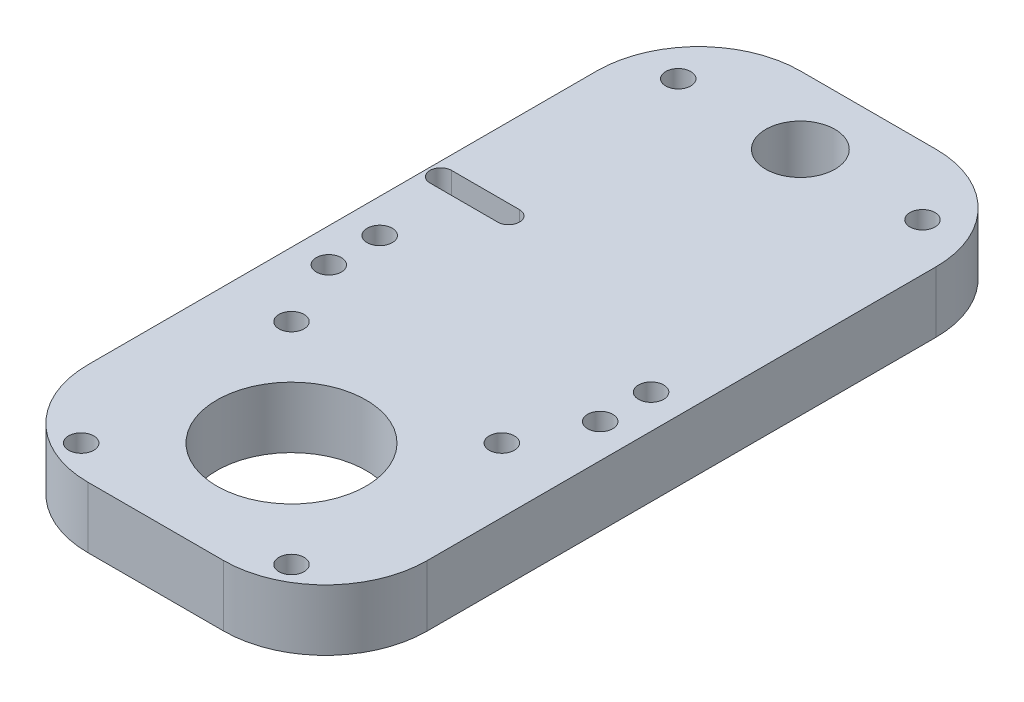
ISO-10303-21;
HEADER;
FILE_DESCRIPTION(('STEP AP214'),'2;1');
FILE_NAME('part.step','',(''),(''),'','','');
FILE_SCHEMA(('AUTOMOTIVE_DESIGN { 1 0 10303 214 1 1 1 1 }'));
ENDSEC;
DATA;
#1=APPLICATION_CONTEXT('core data for automotive mechanical design processes');
#2=APPLICATION_PROTOCOL_DEFINITION('international standard','automotive_design',2000,#1);
#3=PRODUCT_CONTEXT('',#1,'mechanical');
#4=PRODUCT('Part','Part','',(#3));
#5=PRODUCT_RELATED_PRODUCT_CATEGORY('part','',(#4));
#6=PRODUCT_DEFINITION_FORMATION('','',#4);
#7=PRODUCT_DEFINITION_CONTEXT('part definition',#1,'design');
#8=PRODUCT_DEFINITION('design','',#6,#7);
#9=PRODUCT_DEFINITION_SHAPE('','',#8);
#10=(LENGTH_UNIT() NAMED_UNIT(*) SI_UNIT(.MILLI.,.METRE.));
#11=(NAMED_UNIT(*) PLANE_ANGLE_UNIT() SI_UNIT($,.RADIAN.));
#12=(NAMED_UNIT(*) SI_UNIT($,.STERADIAN.) SOLID_ANGLE_UNIT());
#13=UNCERTAINTY_MEASURE_WITH_UNIT(LENGTH_MEASURE(1.E-05),#10,'distance_accuracy_value','');
#14=(GEOMETRIC_REPRESENTATION_CONTEXT(3) GLOBAL_UNCERTAINTY_ASSIGNED_CONTEXT((#13)) GLOBAL_UNIT_ASSIGNED_CONTEXT((#10,
#11,#12)) REPRESENTATION_CONTEXT('',''));
#15=CARTESIAN_POINT('',(0.,0.,0.));
#16=DIRECTION('',(0.,0.,1.));
#17=DIRECTION('',(1.,0.,0.));
#18=AXIS2_PLACEMENT_3D('',#15,#16,#17);
#19=CARTESIAN_POINT('',(9.4889673714967,9.,12.4156887607424));
#20=DIRECTION('',(1.,0.,0.));
#21=DIRECTION('',(0.,0.,-1.));
#22=AXIS2_PLACEMENT_3D('',#19,#20,#21);
#23=PLANE('',#22);
#24=DIRECTION('',(0.,0.,1.));
#25=VECTOR('',#24,1.);
#26=CARTESIAN_POINT('',(9.4889673714967,0.,12.4156887607424));
#27=LINE('',#26,#25);
#28=CARTESIAN_POINT('',(9.4889673714967,0.,-77.5843112392576));
#29=VERTEX_POINT('',#28);
#30=CARTESIAN_POINT('',(9.4889673714967,0.,-2.58431123925762));
#31=VERTEX_POINT('',#30);
#32=EDGE_CURVE('E204',#29,#31,#27,.T.);
#33=ORIENTED_EDGE('',*,*,#32,.T.);
#34=DIRECTION('',(0.,-1.,0.));
#35=VECTOR('',#34,1.);
#36=CARTESIAN_POINT('',(9.4889673714967,9.,-2.58431123925762));
#37=LINE('',#36,#35);
#38=CARTESIAN_POINT('',(9.4889673714967,9.,-2.58431123925762));
#39=VERTEX_POINT('',#38);
#40=EDGE_CURVE('E267',#31,#39,#37,.F.);
#41=ORIENTED_EDGE('',*,*,#40,.T.);
#42=DIRECTION('',(0.,0.,1.));
#43=VECTOR('',#42,1.);
#44=CARTESIAN_POINT('',(9.4889673714967,9.,12.4156887607424));
#45=LINE('',#44,#43);
#46=CARTESIAN_POINT('',(9.4889673714967,9.,-77.5843112392576));
#47=VERTEX_POINT('',#46);
#48=EDGE_CURVE('E207',#47,#39,#45,.T.);
#49=ORIENTED_EDGE('',*,*,#48,.F.);
#50=DIRECTION('',(0.,-1.,0.));
#51=VECTOR('',#50,1.);
#52=CARTESIAN_POINT('',(9.4889673714967,9.,-77.5843112392576));
#53=LINE('',#52,#51);
#54=EDGE_CURVE('E264',#47,#29,#53,.T.);
#55=ORIENTED_EDGE('',*,*,#54,.T.);
#56=EDGE_LOOP('',(#33,#41,#49,#55));
#57=FACE_BOUND('',#56,.T.);
#58=ADVANCED_FACE('F32',(#57),#23,.F.);
#59=CARTESIAN_POINT('',(9.4889673714967,9.,12.4156887607424));
#60=DIRECTION('',(0.,0.,-1.));
#61=DIRECTION('',(-1.,0.,0.));
#62=AXIS2_PLACEMENT_3D('',#59,#60,#61);
#63=PLANE('',#62);
#64=DIRECTION('',(1.,0.,0.));
#65=VECTOR('',#64,1.);
#66=CARTESIAN_POINT('',(9.4889673714967,0.,12.4156887607424));
#67=LINE('',#66,#65);
#68=CARTESIAN_POINT('',(24.4889673714967,0.,12.4156887607424));
#69=VERTEX_POINT('',#68);
#70=CARTESIAN_POINT('',(44.4889673714967,0.,12.4156887607424));
#71=VERTEX_POINT('',#70);
#72=EDGE_CURVE('E221',#69,#71,#67,.T.);
#73=ORIENTED_EDGE('',*,*,#72,.T.);
#74=DIRECTION('',(0.,-1.,0.));
#75=VECTOR('',#74,1.);
#76=CARTESIAN_POINT('',(44.4889673714967,9.,12.4156887607424));
#77=LINE('',#76,#75);
#78=CARTESIAN_POINT('',(44.4889673714967,9.,12.4156887607424));
#79=VERTEX_POINT('',#78);
#80=EDGE_CURVE('E255',#71,#79,#77,.F.);
#81=ORIENTED_EDGE('',*,*,#80,.T.);
#82=DIRECTION('',(1.,0.,0.));
#83=VECTOR('',#82,1.);
#84=CARTESIAN_POINT('',(9.4889673714967,9.,12.4156887607424));
#85=LINE('',#84,#83);
#86=CARTESIAN_POINT('',(24.4889673714967,9.,12.4156887607424));
#87=VERTEX_POINT('',#86);
#88=EDGE_CURVE('E210',#87,#79,#85,.T.);
#89=ORIENTED_EDGE('',*,*,#88,.F.);
#90=DIRECTION('',(0.,-1.,0.));
#91=VECTOR('',#90,1.);
#92=CARTESIAN_POINT('',(24.4889673714967,9.,12.4156887607424));
#93=LINE('',#92,#91);
#94=EDGE_CURVE('E252',#87,#69,#93,.T.);
#95=ORIENTED_EDGE('',*,*,#94,.T.);
#96=EDGE_LOOP('',(#73,#81,#89,#95));
#97=FACE_BOUND('',#96,.T.);
#98=ADVANCED_FACE('F282',(#97),#63,.F.);
#99=CARTESIAN_POINT('',(59.4889673714967,9.,12.4156887607424));
#100=DIRECTION('',(-1.,0.,0.));
#101=DIRECTION('',(0.,0.,1.));
#102=AXIS2_PLACEMENT_3D('',#99,#100,#101);
#103=PLANE('',#102);
#104=DIRECTION('',(0.,0.,-1.));
#105=VECTOR('',#104,1.);
#106=CARTESIAN_POINT('',(59.4889673714967,9.,12.4156887607424));
#107=LINE('',#106,#105);
#108=CARTESIAN_POINT('',(59.4889673714967,9.,-2.58431123925762));
#109=VERTEX_POINT('',#108);
#110=CARTESIAN_POINT('',(59.4889673714967,9.,-77.5843112392576));
#111=VERTEX_POINT('',#110);
#112=EDGE_CURVE('E214',#109,#111,#107,.T.);
#113=ORIENTED_EDGE('',*,*,#112,.F.);
#114=DIRECTION('',(0.,-1.,0.));
#115=VECTOR('',#114,1.);
#116=CARTESIAN_POINT('',(59.4889673714967,9.,-2.58431123925762));
#117=LINE('',#116,#115);
#118=CARTESIAN_POINT('',(59.4889673714967,0.,-2.58431123925762));
#119=VERTEX_POINT('',#118);
#120=EDGE_CURVE('E241',#109,#119,#117,.T.);
#121=ORIENTED_EDGE('',*,*,#120,.T.);
#122=DIRECTION('',(0.,0.,-1.));
#123=VECTOR('',#122,1.);
#124=CARTESIAN_POINT('',(59.4889673714967,0.,12.4156887607424));
#125=LINE('',#124,#123);
#126=CARTESIAN_POINT('',(59.4889673714967,0.,-77.5843112392576));
#127=VERTEX_POINT('',#126);
#128=EDGE_CURVE('E224',#119,#127,#125,.T.);
#129=ORIENTED_EDGE('',*,*,#128,.T.);
#130=DIRECTION('',(0.,-1.,0.));
#131=VECTOR('',#130,1.);
#132=CARTESIAN_POINT('',(59.4889673714967,9.,-77.5843112392576));
#133=LINE('',#132,#131);
#134=EDGE_CURVE('E218',#127,#111,#133,.F.);
#135=ORIENTED_EDGE('',*,*,#134,.T.);
#136=EDGE_LOOP('',(#113,#121,#129,#135));
#137=FACE_BOUND('',#136,.T.);
#138=ADVANCED_FACE('F292',(#137),#103,.F.);
#139=CARTESIAN_POINT('',(9.4889673714967,9.,-92.5843112392576));
#140=DIRECTION('',(0.,0.,1.));
#141=DIRECTION('',(1.,0.,0.));
#142=AXIS2_PLACEMENT_3D('',#139,#140,#141);
#143=PLANE('',#142);
#144=DIRECTION('',(-1.,0.,0.));
#145=VECTOR('',#144,1.);
#146=CARTESIAN_POINT('',(9.4889673714967,9.,-92.5843112392576));
#147=LINE('',#146,#145);
#148=CARTESIAN_POINT('',(44.4889673714967,9.,-92.5843112392576));
#149=VERTEX_POINT('',#148);
#150=CARTESIAN_POINT('',(24.4889673714967,9.,-92.5843112392576));
#151=VERTEX_POINT('',#150);
#152=EDGE_CURVE('E216',#149,#151,#147,.T.);
#153=ORIENTED_EDGE('',*,*,#152,.F.);
#154=DIRECTION('',(0.,-1.,0.));
#155=VECTOR('',#154,1.);
#156=CARTESIAN_POINT('',(44.4889673714967,9.,-92.5843112392576));
#157=LINE('',#156,#155);
#158=CARTESIAN_POINT('',(44.4889673714967,0.,-92.5843112392576));
#159=VERTEX_POINT('',#158);
#160=EDGE_CURVE('E11',#149,#159,#157,.T.);
#161=ORIENTED_EDGE('',*,*,#160,.T.);
#162=DIRECTION('',(-1.,0.,0.));
#163=VECTOR('',#162,1.);
#164=CARTESIAN_POINT('',(9.4889673714967,0.,-92.5843112392576));
#165=LINE('',#164,#163);
#166=CARTESIAN_POINT('',(24.4889673714967,0.,-92.5843112392576));
#167=VERTEX_POINT('',#166);
#168=EDGE_CURVE('E211',#159,#167,#165,.T.);
#169=ORIENTED_EDGE('',*,*,#168,.T.);
#170=DIRECTION('',(0.,-1.,0.));
#171=VECTOR('',#170,1.);
#172=CARTESIAN_POINT('',(24.4889673714967,9.,-92.5843112392576));
#173=LINE('',#172,#171);
#174=EDGE_CURVE('E40',#167,#151,#173,.F.);
#175=ORIENTED_EDGE('',*,*,#174,.T.);
#176=EDGE_LOOP('',(#153,#161,#169,#175));
#177=FACE_BOUND('',#176,.T.);
#178=ADVANCED_FACE('F298',(#177),#143,.F.);
#179=CARTESIAN_POINT('',(0.,9.,0.));
#180=DIRECTION('',(0.,-1.,0.));
#181=DIRECTION('',(0.,0.,-1.));
#182=AXIS2_PLACEMENT_3D('',#179,#180,#181);
#183=PLANE('',#182);
#184=CARTESIAN_POINT('',(14.4889673714967,9.,-33.0843112392576));
#185=DIRECTION('',(0.,1.,0.));
#186=DIRECTION('',(0.,0.,1.));
#187=AXIS2_PLACEMENT_3D('',#184,#185,#186);
#188=CIRCLE('',#187,1.85);
#189=CARTESIAN_POINT('',(14.4889673714967,9.,-31.2343112392576));
#190=VERTEX_POINT('',#189);
#191=EDGE_CURVE('E539',#190,#190,#188,.T.);
#192=ORIENTED_EDGE('',*,*,#191,.F.);
#193=EDGE_LOOP('',(#192));
#194=FACE_BOUND('',#193,.T.);
#195=CARTESIAN_POINT('',(54.4889673714967,9.,-33.0843112392576));
#196=DIRECTION('',(0.,1.,0.));
#197=DIRECTION('',(0.,0.,1.));
#198=AXIS2_PLACEMENT_3D('',#195,#196,#197);
#199=CIRCLE('',#198,1.85);
#200=CARTESIAN_POINT('',(54.4889673714967,9.,-31.2343112392576));
#201=VERTEX_POINT('',#200);
#202=EDGE_CURVE('E543',#201,#201,#199,.T.);
#203=ORIENTED_EDGE('',*,*,#202,.F.);
#204=EDGE_LOOP('',(#203));
#205=FACE_BOUND('',#204,.T.);
#206=CARTESIAN_POINT('',(54.4889673714967,9.,-40.5843112392576));
#207=DIRECTION('',(0.,1.,0.));
#208=DIRECTION('',(0.,0.,1.));
#209=AXIS2_PLACEMENT_3D('',#206,#207,#208);
#210=CIRCLE('',#209,1.85);
#211=CARTESIAN_POINT('',(54.4889673714967,9.,-38.7343112392576));
#212=VERTEX_POINT('',#211);
#213=EDGE_CURVE('E547',#212,#212,#210,.T.);
#214=ORIENTED_EDGE('',*,*,#213,.F.);
#215=EDGE_LOOP('',(#214));
#216=FACE_BOUND('',#215,.T.);
#217=CARTESIAN_POINT('',(14.4889673714967,9.,-40.5843112392576));
#218=DIRECTION('',(0.,1.,0.));
#219=DIRECTION('',(0.,0.,1.));
#220=AXIS2_PLACEMENT_3D('',#217,#218,#219);
#221=CIRCLE('',#220,1.85);
#222=CARTESIAN_POINT('',(14.4889673714967,9.,-38.7343112392576));
#223=VERTEX_POINT('',#222);
#224=EDGE_CURVE('E232',#223,#223,#221,.T.);
#225=ORIENTED_EDGE('',*,*,#224,.F.);
#226=EDGE_LOOP('',(#225));
#227=FACE_BOUND('',#226,.T.);
#228=CARTESIAN_POINT('',(18.9889673714967,9.,7.91568876074238));
#229=DIRECTION('',(0.,1.,0.));
#230=DIRECTION('',(0.,0.,1.));
#231=AXIS2_PLACEMENT_3D('',#228,#229,#230);
#232=CIRCLE('',#231,1.85000000000001);
#233=CARTESIAN_POINT('',(18.9889673714967,9.,9.76568876074239));
#234=VERTEX_POINT('',#233);
#235=EDGE_CURVE('E185',#234,#234,#232,.T.);
#236=ORIENTED_EDGE('',*,*,#235,.F.);
#237=EDGE_LOOP('',(#236));
#238=FACE_BOUND('',#237,.T.);
#239=CARTESIAN_POINT('',(49.9889673714967,9.,-23.0843112392576));
#240=DIRECTION('',(0.,1.,0.));
#241=DIRECTION('',(0.,0.,1.));
#242=AXIS2_PLACEMENT_3D('',#239,#240,#241);
#243=CIRCLE('',#242,1.85);
#244=CARTESIAN_POINT('',(49.9889673714967,9.,-21.2343112392576));
#245=VERTEX_POINT('',#244);
#246=EDGE_CURVE('E179',#245,#245,#243,.T.);
#247=ORIENTED_EDGE('',*,*,#246,.F.);
#248=EDGE_LOOP('',(#247));
#249=FACE_BOUND('',#248,.T.);
#250=CARTESIAN_POINT('',(34.4889673714967,9.,-7.58431123925762));
#251=DIRECTION('',(0.,1.,0.));
#252=DIRECTION('',(0.,0.,1.));
#253=AXIS2_PLACEMENT_3D('',#250,#251,#252);
#254=CIRCLE('',#253,11.);
#255=CARTESIAN_POINT('',(34.4889673714967,9.,3.41568876074237));
#256=VERTEX_POINT('',#255);
#257=EDGE_CURVE('E178',#256,#256,#254,.T.);
#258=ORIENTED_EDGE('',*,*,#257,.F.);
#259=EDGE_LOOP('',(#258));
#260=FACE_BOUND('',#259,.T.);
#261=CARTESIAN_POINT('',(16.4889673714967,9.,-82.5843112392576));
#262=DIRECTION('',(0.,1.,0.));
#263=DIRECTION('',(0.,0.,1.));
#264=AXIS2_PLACEMENT_3D('',#261,#262,#263);
#265=CIRCLE('',#264,1.85);
#266=CARTESIAN_POINT('',(16.4889673714967,9.,-80.7343112392576));
#267=VERTEX_POINT('',#266);
#268=EDGE_CURVE('E193',#267,#267,#265,.T.);
#269=ORIENTED_EDGE('',*,*,#268,.F.);
#270=EDGE_LOOP('',(#269));
#271=FACE_BOUND('',#270,.T.);
#272=CARTESIAN_POINT('',(49.9889673714967,9.,7.91568876074238));
#273=DIRECTION('',(0.,1.,0.));
#274=DIRECTION('',(0.,0.,1.));
#275=AXIS2_PLACEMENT_3D('',#272,#273,#274);
#276=CIRCLE('',#275,1.85);
#277=CARTESIAN_POINT('',(49.9889673714967,9.,9.76568876074238));
#278=VERTEX_POINT('',#277);
#279=EDGE_CURVE('E562',#278,#278,#276,.T.);
#280=ORIENTED_EDGE('',*,*,#279,.F.);
#281=EDGE_LOOP('',(#280));
#282=FACE_BOUND('',#281,.T.);
#283=CARTESIAN_POINT('',(18.9889673714967,9.,-23.0843112392576));
#284=DIRECTION('',(0.,1.,0.));
#285=DIRECTION('',(0.,0.,1.));
#286=AXIS2_PLACEMENT_3D('',#283,#284,#285);
#287=CIRCLE('',#286,1.85000000000002);
#288=CARTESIAN_POINT('',(18.9889673714967,9.,-21.2343112392576));
#289=VERTEX_POINT('',#288);
#290=EDGE_CURVE('E153',#289,#289,#287,.T.);
#291=ORIENTED_EDGE('',*,*,#290,.F.);
#292=EDGE_LOOP('',(#291));
#293=FACE_BOUND('',#292,.T.);
#294=DIRECTION('',(-1.,0.,0.));
#295=VECTOR('',#294,1.);
#296=CARTESIAN_POINT('',(21.4889673714967,9.,-54.1843112392576));
#297=LINE('',#296,#295);
#298=CARTESIAN_POINT('',(21.4889673714967,9.,-54.1843112392576));
#299=VERTEX_POINT('',#298);
#300=CARTESIAN_POINT('',(11.4889673714967,9.,-54.1843112392576));
#301=VERTEX_POINT('',#300);
#302=EDGE_CURVE('E159',#299,#301,#297,.T.);
#303=ORIENTED_EDGE('',*,*,#302,.F.);
#304=CARTESIAN_POINT('',(21.4889673714967,9.,-52.5843112392576));
#305=DIRECTION('',(0.,1.,0.));
#306=DIRECTION('',(0.,0.,1.));
#307=AXIS2_PLACEMENT_3D('',#304,#305,#306);
#308=CIRCLE('',#307,1.6);
#309=CARTESIAN_POINT('',(21.4889673714967,9.,-50.9843112392576));
#310=VERTEX_POINT('',#309);
#311=EDGE_CURVE('E129',#310,#299,#308,.T.);
#312=ORIENTED_EDGE('',*,*,#311,.F.);
#313=DIRECTION('',(1.,0.,0.));
#314=VECTOR('',#313,1.);
#315=CARTESIAN_POINT('',(21.4889673714967,9.,-50.9843112392576));
#316=LINE('',#315,#314);
#317=CARTESIAN_POINT('',(11.4889673714967,9.,-50.9843112392576));
#318=VERTEX_POINT('',#317);
#319=EDGE_CURVE('E147',#318,#310,#316,.T.);
#320=ORIENTED_EDGE('',*,*,#319,.F.);
#321=CARTESIAN_POINT('',(11.4889673714967,9.,-52.5843112392576));
#322=DIRECTION('',(0.,1.,0.));
#323=DIRECTION('',(0.,0.,1.));
#324=AXIS2_PLACEMENT_3D('',#321,#322,#323);
#325=CIRCLE('',#324,1.59999999999999);
#326=EDGE_CURVE('E150',#301,#318,#325,.T.);
#327=ORIENTED_EDGE('',*,*,#326,.F.);
#328=EDGE_LOOP('',(#303,#312,#320,#327));
#329=FACE_BOUND('',#328,.T.);
#330=CARTESIAN_POINT('',(52.4889673714967,9.,-82.5843112392576));
#331=DIRECTION('',(0.,1.,0.));
#332=DIRECTION('',(0.,0.,1.));
#333=AXIS2_PLACEMENT_3D('',#330,#331,#332);
#334=CIRCLE('',#333,1.85000000000001);
#335=CARTESIAN_POINT('',(52.4889673714967,9.,-80.7343112392576));
#336=VERTEX_POINT('',#335);
#337=EDGE_CURVE('E171',#336,#336,#334,.T.);
#338=ORIENTED_EDGE('',*,*,#337,.F.);
#339=EDGE_LOOP('',(#338));
#340=FACE_BOUND('',#339,.T.);
#341=CARTESIAN_POINT('',(34.4889673714967,9.,-82.5843112392576));
#342=DIRECTION('',(0.,1.,0.));
#343=DIRECTION('',(0.,0.,1.));
#344=AXIS2_PLACEMENT_3D('',#341,#342,#343);
#345=CIRCLE('',#344,5.1);
#346=CARTESIAN_POINT('',(34.4889673714967,9.,-77.4843112392576));
#347=VERTEX_POINT('',#346);
#348=EDGE_CURVE('E192',#347,#347,#345,.T.);
#349=ORIENTED_EDGE('',*,*,#348,.F.);
#350=EDGE_LOOP('',(#349));
#351=FACE_BOUND('',#350,.T.);
#352=ORIENTED_EDGE('',*,*,#88,.T.);
#353=CARTESIAN_POINT('',(44.4889673714967,9.,-2.58431123925762));
#354=DIRECTION('',(0.,-1.,0.));
#355=DIRECTION('',(0.,0.,-1.));
#356=AXIS2_PLACEMENT_3D('',#353,#354,#355);
#357=CIRCLE('',#356,15.);
#358=EDGE_CURVE('E262',#79,#109,#357,.F.);
#359=ORIENTED_EDGE('',*,*,#358,.T.);
#360=ORIENTED_EDGE('',*,*,#112,.T.);
#361=CARTESIAN_POINT('',(44.4889673714967,9.,-77.5843112392576));
#362=DIRECTION('',(0.,-1.,0.));
#363=DIRECTION('',(0.,0.,-1.));
#364=AXIS2_PLACEMENT_3D('',#361,#362,#363);
#365=CIRCLE('',#364,15.);
#366=EDGE_CURVE('E53',#111,#149,#365,.F.);
#367=ORIENTED_EDGE('',*,*,#366,.T.);
#368=ORIENTED_EDGE('',*,*,#152,.T.);
#369=CARTESIAN_POINT('',(24.4889673714967,9.,-77.5843112392576));
#370=DIRECTION('',(0.,-1.,0.));
#371=DIRECTION('',(0.,0.,-1.));
#372=AXIS2_PLACEMENT_3D('',#369,#370,#371);
#373=CIRCLE('',#372,15.);
#374=EDGE_CURVE('E257',#151,#47,#373,.F.);
#375=ORIENTED_EDGE('',*,*,#374,.T.);
#376=ORIENTED_EDGE('',*,*,#48,.T.);
#377=CARTESIAN_POINT('',(24.4889673714967,9.,-2.58431123925762));
#378=DIRECTION('',(0.,-1.,0.));
#379=DIRECTION('',(0.,0.,-1.));
#380=AXIS2_PLACEMENT_3D('',#377,#378,#379);
#381=CIRCLE('',#380,15.);
#382=EDGE_CURVE('E260',#39,#87,#381,.F.);
#383=ORIENTED_EDGE('',*,*,#382,.T.);
#384=EDGE_LOOP('',(#352,#359,#360,#367,#368,#375,#376,#383));
#385=FACE_BOUND('',#384,.T.);
#386=ADVANCED_FACE('F275',(#194,#205,#216,#227,#238,#249,#260,#271,#282,#293,#329,#340,#351,
#385),#183,.F.);
#387=CARTESIAN_POINT('',(0.,0.,0.));
#388=DIRECTION('',(0.,-1.,0.));
#389=DIRECTION('',(0.,0.,-1.));
#390=AXIS2_PLACEMENT_3D('',#387,#388,#389);
#391=PLANE('',#390);
#392=CARTESIAN_POINT('',(14.4889673714967,0.,-33.0843112392576));
#393=DIRECTION('',(0.,-1.,0.));
#394=DIRECTION('',(0.,0.,-1.));
#395=AXIS2_PLACEMENT_3D('',#392,#393,#394);
#396=CIRCLE('',#395,1.85);
#397=CARTESIAN_POINT('',(14.4889673714967,0.,-34.9343112392576));
#398=VERTEX_POINT('',#397);
#399=EDGE_CURVE('E174',#398,#398,#396,.T.);
#400=ORIENTED_EDGE('',*,*,#399,.F.);
#401=EDGE_LOOP('',(#400));
#402=FACE_BOUND('',#401,.T.);
#403=CARTESIAN_POINT('',(54.4889673714967,0.,-33.0843112392576));
#404=DIRECTION('',(0.,-1.,0.));
#405=DIRECTION('',(0.,0.,-1.));
#406=AXIS2_PLACEMENT_3D('',#403,#404,#405);
#407=CIRCLE('',#406,1.85);
#408=CARTESIAN_POINT('',(54.4889673714967,0.,-34.9343112392576));
#409=VERTEX_POINT('',#408);
#410=EDGE_CURVE('E235',#409,#409,#407,.T.);
#411=ORIENTED_EDGE('',*,*,#410,.F.);
#412=EDGE_LOOP('',(#411));
#413=FACE_BOUND('',#412,.T.);
#414=CARTESIAN_POINT('',(54.4889673714967,0.,-40.5843112392576));
#415=DIRECTION('',(0.,-1.,0.));
#416=DIRECTION('',(0.,0.,-1.));
#417=AXIS2_PLACEMENT_3D('',#414,#415,#416);
#418=CIRCLE('',#417,1.85);
#419=CARTESIAN_POINT('',(54.4889673714967,0.,-42.4343112392576));
#420=VERTEX_POINT('',#419);
#421=EDGE_CURVE('E231',#420,#420,#418,.T.);
#422=ORIENTED_EDGE('',*,*,#421,.F.);
#423=EDGE_LOOP('',(#422));
#424=FACE_BOUND('',#423,.T.);
#425=CARTESIAN_POINT('',(14.4889673714967,0.,-40.5843112392576));
#426=DIRECTION('',(0.,-1.,0.));
#427=DIRECTION('',(0.,0.,-1.));
#428=AXIS2_PLACEMENT_3D('',#425,#426,#427);
#429=CIRCLE('',#428,1.85);
#430=CARTESIAN_POINT('',(14.4889673714967,0.,-42.4343112392576));
#431=VERTEX_POINT('',#430);
#432=EDGE_CURVE('E228',#431,#431,#429,.T.);
#433=ORIENTED_EDGE('',*,*,#432,.F.);
#434=EDGE_LOOP('',(#433));
#435=FACE_BOUND('',#434,.T.);
#436=CARTESIAN_POINT('',(18.9889673714967,0.,7.91568876074238));
#437=DIRECTION('',(0.,1.,0.));
#438=DIRECTION('',(0.,0.,1.));
#439=AXIS2_PLACEMENT_3D('',#436,#437,#438);
#440=CIRCLE('',#439,1.85000000000001);
#441=CARTESIAN_POINT('',(18.9889673714967,0.,9.76568876074239));
#442=VERTEX_POINT('',#441);
#443=EDGE_CURVE('E182',#442,#442,#440,.T.);
#444=ORIENTED_EDGE('',*,*,#443,.T.);
#445=EDGE_LOOP('',(#444));
#446=FACE_BOUND('',#445,.T.);
#447=CARTESIAN_POINT('',(49.9889673714967,0.,-23.0843112392576));
#448=DIRECTION('',(0.,1.,0.));
#449=DIRECTION('',(0.,0.,1.));
#450=AXIS2_PLACEMENT_3D('',#447,#448,#449);
#451=CIRCLE('',#450,1.85);
#452=CARTESIAN_POINT('',(49.9889673714967,0.,-21.2343112392576));
#453=VERTEX_POINT('',#452);
#454=EDGE_CURVE('E175',#453,#453,#451,.T.);
#455=ORIENTED_EDGE('',*,*,#454,.T.);
#456=EDGE_LOOP('',(#455));
#457=FACE_BOUND('',#456,.T.);
#458=CARTESIAN_POINT('',(34.4889673714967,0.,-7.58431123925762));
#459=DIRECTION('',(0.,1.,0.));
#460=DIRECTION('',(0.,0.,1.));
#461=AXIS2_PLACEMENT_3D('',#458,#459,#460);
#462=CIRCLE('',#461,11.);
#463=CARTESIAN_POINT('',(34.4889673714967,0.,3.41568876074237));
#464=VERTEX_POINT('',#463);
#465=EDGE_CURVE('E196',#464,#464,#462,.T.);
#466=ORIENTED_EDGE('',*,*,#465,.T.);
#467=EDGE_LOOP('',(#466));
#468=FACE_BOUND('',#467,.T.);
#469=CARTESIAN_POINT('',(16.4889673714967,0.,-82.5843112392576));
#470=DIRECTION('',(0.,1.,0.));
#471=DIRECTION('',(0.,0.,1.));
#472=AXIS2_PLACEMENT_3D('',#469,#470,#471);
#473=CIRCLE('',#472,1.85);
#474=CARTESIAN_POINT('',(16.4889673714967,0.,-80.7343112392576));
#475=VERTEX_POINT('',#474);
#476=EDGE_CURVE('E189',#475,#475,#473,.T.);
#477=ORIENTED_EDGE('',*,*,#476,.T.);
#478=EDGE_LOOP('',(#477));
#479=FACE_BOUND('',#478,.T.);
#480=CARTESIAN_POINT('',(49.9889673714967,0.,7.91568876074238));
#481=DIRECTION('',(0.,1.,0.));
#482=DIRECTION('',(0.,0.,1.));
#483=AXIS2_PLACEMENT_3D('',#480,#481,#482);
#484=CIRCLE('',#483,1.85);
#485=CARTESIAN_POINT('',(49.9889673714967,0.,9.76568876074238));
#486=VERTEX_POINT('',#485);
#487=EDGE_CURVE('E188',#486,#486,#484,.T.);
#488=ORIENTED_EDGE('',*,*,#487,.T.);
#489=EDGE_LOOP('',(#488));
#490=FACE_BOUND('',#489,.T.);
#491=CARTESIAN_POINT('',(18.9889673714967,0.,-23.0843112392576));
#492=DIRECTION('',(0.,1.,0.));
#493=DIRECTION('',(0.,0.,1.));
#494=AXIS2_PLACEMENT_3D('',#491,#492,#493);
#495=CIRCLE('',#494,1.85000000000002);
#496=CARTESIAN_POINT('',(18.9889673714967,0.,-21.2343112392576));
#497=VERTEX_POINT('',#496);
#498=EDGE_CURVE('E575',#497,#497,#495,.T.);
#499=ORIENTED_EDGE('',*,*,#498,.T.);
#500=EDGE_LOOP('',(#499));
#501=FACE_BOUND('',#500,.T.);
#502=CARTESIAN_POINT('',(21.4889673714967,0.,-52.5843112392576));
#503=DIRECTION('',(0.,1.,0.));
#504=DIRECTION('',(0.,0.,1.));
#505=AXIS2_PLACEMENT_3D('',#502,#503,#504);
#506=CIRCLE('',#505,1.6);
#507=CARTESIAN_POINT('',(21.4889673714967,0.,-50.9843112392576));
#508=VERTEX_POINT('',#507);
#509=CARTESIAN_POINT('',(21.4889673714967,0.,-54.1843112392576));
#510=VERTEX_POINT('',#509);
#511=EDGE_CURVE('E126',#508,#510,#506,.T.);
#512=ORIENTED_EDGE('',*,*,#511,.T.);
#513=DIRECTION('',(-1.,0.,0.));
#514=VECTOR('',#513,1.);
#515=CARTESIAN_POINT('',(21.4889673714967,0.,-54.1843112392576));
#516=LINE('',#515,#514);
#517=CARTESIAN_POINT('',(11.4889673714967,0.,-54.1843112392576));
#518=VERTEX_POINT('',#517);
#519=EDGE_CURVE('E138',#510,#518,#516,.T.);
#520=ORIENTED_EDGE('',*,*,#519,.T.);
#521=CARTESIAN_POINT('',(11.4889673714967,0.,-52.5843112392576));
#522=DIRECTION('',(0.,1.,0.));
#523=DIRECTION('',(0.,0.,1.));
#524=AXIS2_PLACEMENT_3D('',#521,#522,#523);
#525=CIRCLE('',#524,1.59999999999999);
#526=CARTESIAN_POINT('',(11.4889673714967,0.,-50.9843112392576));
#527=VERTEX_POINT('',#526);
#528=EDGE_CURVE('E142',#518,#527,#525,.T.);
#529=ORIENTED_EDGE('',*,*,#528,.T.);
#530=DIRECTION('',(1.,0.,0.));
#531=VECTOR('',#530,1.);
#532=CARTESIAN_POINT('',(21.4889673714967,0.,-50.9843112392576));
#533=LINE('',#532,#531);
#534=EDGE_CURVE('E134',#527,#508,#533,.T.);
#535=ORIENTED_EDGE('',*,*,#534,.T.);
#536=EDGE_LOOP('',(#512,#520,#529,#535));
#537=FACE_BOUND('',#536,.T.);
#538=CARTESIAN_POINT('',(52.4889673714967,0.,-82.5843112392576));
#539=DIRECTION('',(0.,1.,0.));
#540=DIRECTION('',(0.,0.,1.));
#541=AXIS2_PLACEMENT_3D('',#538,#539,#540);
#542=CIRCLE('',#541,1.85000000000001);
#543=CARTESIAN_POINT('',(52.4889673714967,0.,-80.7343112392576));
#544=VERTEX_POINT('',#543);
#545=EDGE_CURVE('E160',#544,#544,#542,.T.);
#546=ORIENTED_EDGE('',*,*,#545,.T.);
#547=EDGE_LOOP('',(#546));
#548=FACE_BOUND('',#547,.T.);
#549=CARTESIAN_POINT('',(34.4889673714967,0.,-82.5843112392576));
#550=DIRECTION('',(0.,1.,0.));
#551=DIRECTION('',(0.,0.,1.));
#552=AXIS2_PLACEMENT_3D('',#549,#550,#551);
#553=CIRCLE('',#552,5.1);
#554=CARTESIAN_POINT('',(34.4889673714967,0.,-77.4843112392576));
#555=VERTEX_POINT('',#554);
#556=EDGE_CURVE('E201',#555,#555,#553,.T.);
#557=ORIENTED_EDGE('',*,*,#556,.T.);
#558=EDGE_LOOP('',(#557));
#559=FACE_BOUND('',#558,.T.);
#560=ORIENTED_EDGE('',*,*,#128,.F.);
#561=CARTESIAN_POINT('',(44.4889673714967,0.,-2.58431123925762));
#562=DIRECTION('',(0.,-1.,0.));
#563=DIRECTION('',(0.,0.,-1.));
#564=AXIS2_PLACEMENT_3D('',#561,#562,#563);
#565=CIRCLE('',#564,15.);
#566=EDGE_CURVE('E250',#119,#71,#565,.T.);
#567=ORIENTED_EDGE('',*,*,#566,.T.);
#568=ORIENTED_EDGE('',*,*,#72,.F.);
#569=CARTESIAN_POINT('',(24.4889673714967,0.,-2.58431123925762));
#570=DIRECTION('',(0.,-1.,0.));
#571=DIRECTION('',(0.,0.,-1.));
#572=AXIS2_PLACEMENT_3D('',#569,#570,#571);
#573=CIRCLE('',#572,15.);
#574=EDGE_CURVE('E248',#69,#31,#573,.T.);
#575=ORIENTED_EDGE('',*,*,#574,.T.);
#576=ORIENTED_EDGE('',*,*,#32,.F.);
#577=CARTESIAN_POINT('',(24.4889673714967,0.,-77.5843112392576));
#578=DIRECTION('',(0.,-1.,0.));
#579=DIRECTION('',(0.,0.,-1.));
#580=AXIS2_PLACEMENT_3D('',#577,#578,#579);
#581=CIRCLE('',#580,15.);
#582=EDGE_CURVE('E244',#29,#167,#581,.T.);
#583=ORIENTED_EDGE('',*,*,#582,.T.);
#584=ORIENTED_EDGE('',*,*,#168,.F.);
#585=CARTESIAN_POINT('',(44.4889673714967,0.,-77.5843112392576));
#586=DIRECTION('',(0.,-1.,0.));
#587=DIRECTION('',(0.,0.,-1.));
#588=AXIS2_PLACEMENT_3D('',#585,#586,#587);
#589=CIRCLE('',#588,15.);
#590=EDGE_CURVE('E246',#159,#127,#589,.T.);
#591=ORIENTED_EDGE('',*,*,#590,.T.);
#592=EDGE_LOOP('',(#560,#567,#568,#575,#576,#583,#584,#591));
#593=FACE_BOUND('',#592,.T.);
#594=ADVANCED_FACE('F144',(#402,#413,#424,#435,#446,#457,#468,#479,#490,#501,#537,#548,#559,
#593),#391,.T.);
#595=CARTESIAN_POINT('',(34.4889673714967,0.,-82.5843112392576));
#596=DIRECTION('',(0.,1.,0.));
#597=DIRECTION('',(0.,0.,1.));
#598=AXIS2_PLACEMENT_3D('',#595,#596,#597);
#599=CYLINDRICAL_SURFACE('',#598,5.1);
#600=ORIENTED_EDGE('',*,*,#556,.F.);
#601=EDGE_LOOP('',(#600));
#602=FACE_BOUND('',#601,.T.);
#603=ORIENTED_EDGE('',*,*,#348,.T.);
#604=EDGE_LOOP('',(#603));
#605=FACE_BOUND('',#604,.T.);
#606=ADVANCED_FACE('F467',(#602,#605),#599,.F.);
#607=CARTESIAN_POINT('',(52.4889673714967,0.,-82.5843112392576));
#608=DIRECTION('',(0.,1.,0.));
#609=DIRECTION('',(0.,0.,1.));
#610=AXIS2_PLACEMENT_3D('',#607,#608,#609);
#611=CYLINDRICAL_SURFACE('',#610,1.85000000000001);
#612=ORIENTED_EDGE('',*,*,#545,.F.);
#613=EDGE_LOOP('',(#612));
#614=FACE_BOUND('',#613,.T.);
#615=ORIENTED_EDGE('',*,*,#337,.T.);
#616=EDGE_LOOP('',(#615));
#617=FACE_BOUND('',#616,.T.);
#618=ADVANCED_FACE('F459',(#614,#617),#611,.F.);
#619=CARTESIAN_POINT('',(21.4889673714967,0.,-52.5843112392576));
#620=DIRECTION('',(0.,1.,0.));
#621=DIRECTION('',(0.,0.,1.));
#622=AXIS2_PLACEMENT_3D('',#619,#620,#621);
#623=CYLINDRICAL_SURFACE('',#622,1.6);
#624=ORIENTED_EDGE('',*,*,#311,.T.);
#625=DIRECTION('',(0.,1.,0.));
#626=VECTOR('',#625,1.);
#627=CARTESIAN_POINT('',(21.4889673714967,0.,-54.1843112392576));
#628=LINE('',#627,#626);
#629=EDGE_CURVE('E122',#510,#299,#628,.T.);
#630=ORIENTED_EDGE('',*,*,#629,.F.);
#631=ORIENTED_EDGE('',*,*,#511,.F.);
#632=DIRECTION('',(0.,1.,0.));
#633=VECTOR('',#632,1.);
#634=CARTESIAN_POINT('',(21.4889673714967,0.,-50.9843112392576));
#635=LINE('',#634,#633);
#636=EDGE_CURVE('E164',#508,#310,#635,.T.);
#637=ORIENTED_EDGE('',*,*,#636,.T.);
#638=EDGE_LOOP('',(#624,#630,#631,#637));
#639=FACE_BOUND('',#638,.T.);
#640=ADVANCED_FACE('F124',(#639),#623,.F.);
#641=CARTESIAN_POINT('',(21.4889673714967,0.,-50.9843112392576));
#642=DIRECTION('',(0.,0.,1.));
#643=DIRECTION('',(1.,0.,0.));
#644=AXIS2_PLACEMENT_3D('',#641,#642,#643);
#645=PLANE('',#644);
#646=ORIENTED_EDGE('',*,*,#319,.T.);
#647=ORIENTED_EDGE('',*,*,#636,.F.);
#648=ORIENTED_EDGE('',*,*,#534,.F.);
#649=DIRECTION('',(0.,1.,0.));
#650=VECTOR('',#649,1.);
#651=CARTESIAN_POINT('',(11.4889673714967,0.,-50.9843112392576));
#652=LINE('',#651,#650);
#653=EDGE_CURVE('E166',#527,#318,#652,.T.);
#654=ORIENTED_EDGE('',*,*,#653,.T.);
#655=EDGE_LOOP('',(#646,#647,#648,#654));
#656=FACE_BOUND('',#655,.T.);
#657=ADVANCED_FACE('F442',(#656),#645,.F.);
#658=CARTESIAN_POINT('',(11.4889673714967,0.,-52.5843112392576));
#659=DIRECTION('',(0.,1.,0.));
#660=DIRECTION('',(0.,0.,1.));
#661=AXIS2_PLACEMENT_3D('',#658,#659,#660);
#662=CYLINDRICAL_SURFACE('',#661,1.59999999999999);
#663=ORIENTED_EDGE('',*,*,#326,.T.);
#664=ORIENTED_EDGE('',*,*,#653,.F.);
#665=ORIENTED_EDGE('',*,*,#528,.F.);
#666=DIRECTION('',(0.,1.,0.));
#667=VECTOR('',#666,1.);
#668=CARTESIAN_POINT('',(11.4889673714967,0.,-54.1843112392576));
#669=LINE('',#668,#667);
#670=EDGE_CURVE('E133',#518,#301,#669,.T.);
#671=ORIENTED_EDGE('',*,*,#670,.T.);
#672=EDGE_LOOP('',(#663,#664,#665,#671));
#673=FACE_BOUND('',#672,.T.);
#674=ADVANCED_FACE('F434',(#673),#662,.F.);
#675=CARTESIAN_POINT('',(21.4889673714967,0.,-54.1843112392576));
#676=DIRECTION('',(0.,0.,-1.));
#677=DIRECTION('',(-1.,0.,0.));
#678=AXIS2_PLACEMENT_3D('',#675,#676,#677);
#679=PLANE('',#678);
#680=ORIENTED_EDGE('',*,*,#302,.T.);
#681=ORIENTED_EDGE('',*,*,#670,.F.);
#682=ORIENTED_EDGE('',*,*,#519,.F.);
#683=ORIENTED_EDGE('',*,*,#629,.T.);
#684=EDGE_LOOP('',(#680,#681,#682,#683));
#685=FACE_BOUND('',#684,.T.);
#686=ADVANCED_FACE('F139',(#685),#679,.F.);
#687=CARTESIAN_POINT('',(18.9889673714967,0.,-23.0843112392576));
#688=DIRECTION('',(0.,1.,0.));
#689=DIRECTION('',(0.,0.,1.));
#690=AXIS2_PLACEMENT_3D('',#687,#688,#689);
#691=CYLINDRICAL_SURFACE('',#690,1.85000000000002);
#692=ORIENTED_EDGE('',*,*,#498,.F.);
#693=EDGE_LOOP('',(#692));
#694=FACE_BOUND('',#693,.T.);
#695=ORIENTED_EDGE('',*,*,#290,.T.);
#696=EDGE_LOOP('',(#695));
#697=FACE_BOUND('',#696,.T.);
#698=ADVANCED_FACE('F417',(#694,#697),#691,.F.);
#699=CARTESIAN_POINT('',(49.9889673714967,0.,7.91568876074238));
#700=DIRECTION('',(0.,1.,0.));
#701=DIRECTION('',(0.,0.,1.));
#702=AXIS2_PLACEMENT_3D('',#699,#700,#701);
#703=CYLINDRICAL_SURFACE('',#702,1.85);
#704=ORIENTED_EDGE('',*,*,#487,.F.);
#705=EDGE_LOOP('',(#704));
#706=FACE_BOUND('',#705,.T.);
#707=ORIENTED_EDGE('',*,*,#279,.T.);
#708=EDGE_LOOP('',(#707));
#709=FACE_BOUND('',#708,.T.);
#710=ADVANCED_FACE('F408',(#706,#709),#703,.F.);
#711=CARTESIAN_POINT('',(16.4889673714967,0.,-82.5843112392576));
#712=DIRECTION('',(0.,1.,0.));
#713=DIRECTION('',(0.,0.,1.));
#714=AXIS2_PLACEMENT_3D('',#711,#712,#713);
#715=CYLINDRICAL_SURFACE('',#714,1.85);
#716=ORIENTED_EDGE('',*,*,#476,.F.);
#717=EDGE_LOOP('',(#716));
#718=FACE_BOUND('',#717,.T.);
#719=ORIENTED_EDGE('',*,*,#268,.T.);
#720=EDGE_LOOP('',(#719));
#721=FACE_BOUND('',#720,.T.);
#722=ADVANCED_FACE('F399',(#718,#721),#715,.F.);
#723=CARTESIAN_POINT('',(34.4889673714967,0.,-7.58431123925762));
#724=DIRECTION('',(0.,1.,0.));
#725=DIRECTION('',(0.,0.,1.));
#726=AXIS2_PLACEMENT_3D('',#723,#724,#725);
#727=CYLINDRICAL_SURFACE('',#726,11.);
#728=ORIENTED_EDGE('',*,*,#465,.F.);
#729=EDGE_LOOP('',(#728));
#730=FACE_BOUND('',#729,.T.);
#731=ORIENTED_EDGE('',*,*,#257,.T.);
#732=EDGE_LOOP('',(#731));
#733=FACE_BOUND('',#732,.T.);
#734=ADVANCED_FACE('F390',(#730,#733),#727,.F.);
#735=CARTESIAN_POINT('',(49.9889673714967,0.,-23.0843112392576));
#736=DIRECTION('',(0.,1.,0.));
#737=DIRECTION('',(0.,0.,1.));
#738=AXIS2_PLACEMENT_3D('',#735,#736,#737);
#739=CYLINDRICAL_SURFACE('',#738,1.85);
#740=ORIENTED_EDGE('',*,*,#454,.F.);
#741=EDGE_LOOP('',(#740));
#742=FACE_BOUND('',#741,.T.);
#743=ORIENTED_EDGE('',*,*,#246,.T.);
#744=EDGE_LOOP('',(#743));
#745=FACE_BOUND('',#744,.T.);
#746=ADVANCED_FACE('F381',(#742,#745),#739,.F.);
#747=CARTESIAN_POINT('',(18.9889673714967,0.,7.91568876074238));
#748=DIRECTION('',(0.,1.,0.));
#749=DIRECTION('',(0.,0.,1.));
#750=AXIS2_PLACEMENT_3D('',#747,#748,#749);
#751=CYLINDRICAL_SURFACE('',#750,1.85000000000001);
#752=ORIENTED_EDGE('',*,*,#443,.F.);
#753=EDGE_LOOP('',(#752));
#754=FACE_BOUND('',#753,.T.);
#755=ORIENTED_EDGE('',*,*,#235,.T.);
#756=EDGE_LOOP('',(#755));
#757=FACE_BOUND('',#756,.T.);
#758=ADVANCED_FACE('F372',(#754,#757),#751,.F.);
#759=CARTESIAN_POINT('',(14.4889673714967,-1.,-40.5843112392576));
#760=DIRECTION('',(0.,1.,0.));
#761=DIRECTION('',(0.,0.,1.));
#762=AXIS2_PLACEMENT_3D('',#759,#760,#761);
#763=CYLINDRICAL_SURFACE('',#762,1.85);
#764=ORIENTED_EDGE('',*,*,#432,.T.);
#765=EDGE_LOOP('',(#764));
#766=FACE_BOUND('',#765,.T.);
#767=ORIENTED_EDGE('',*,*,#224,.T.);
#768=EDGE_LOOP('',(#767));
#769=FACE_BOUND('',#768,.T.);
#770=ADVANCED_FACE('F363',(#766,#769),#763,.F.);
#771=CARTESIAN_POINT('',(54.4889673714967,-1.,-40.5843112392576));
#772=DIRECTION('',(0.,1.,0.));
#773=DIRECTION('',(0.,0.,1.));
#774=AXIS2_PLACEMENT_3D('',#771,#772,#773);
#775=CYLINDRICAL_SURFACE('',#774,1.85);
#776=ORIENTED_EDGE('',*,*,#421,.T.);
#777=EDGE_LOOP('',(#776));
#778=FACE_BOUND('',#777,.T.);
#779=ORIENTED_EDGE('',*,*,#213,.T.);
#780=EDGE_LOOP('',(#779));
#781=FACE_BOUND('',#780,.T.);
#782=ADVANCED_FACE('F354',(#778,#781),#775,.F.);
#783=CARTESIAN_POINT('',(54.4889673714967,-1.,-33.0843112392576));
#784=DIRECTION('',(0.,1.,0.));
#785=DIRECTION('',(0.,0.,1.));
#786=AXIS2_PLACEMENT_3D('',#783,#784,#785);
#787=CYLINDRICAL_SURFACE('',#786,1.85);
#788=ORIENTED_EDGE('',*,*,#410,.T.);
#789=EDGE_LOOP('',(#788));
#790=FACE_BOUND('',#789,.T.);
#791=ORIENTED_EDGE('',*,*,#202,.T.);
#792=EDGE_LOOP('',(#791));
#793=FACE_BOUND('',#792,.T.);
#794=ADVANCED_FACE('F345',(#790,#793),#787,.F.);
#795=CARTESIAN_POINT('',(14.4889673714967,-1.,-33.0843112392576));
#796=DIRECTION('',(0.,1.,0.));
#797=DIRECTION('',(0.,0.,1.));
#798=AXIS2_PLACEMENT_3D('',#795,#796,#797);
#799=CYLINDRICAL_SURFACE('',#798,1.85);
#800=ORIENTED_EDGE('',*,*,#399,.T.);
#801=EDGE_LOOP('',(#800));
#802=FACE_BOUND('',#801,.T.);
#803=ORIENTED_EDGE('',*,*,#191,.T.);
#804=EDGE_LOOP('',(#803));
#805=FACE_BOUND('',#804,.T.);
#806=ADVANCED_FACE('F314',(#802,#805),#799,.F.);
#807=CARTESIAN_POINT('',(44.4889673714967,9.,-2.58431123925762));
#808=DIRECTION('',(0.,-1.,0.));
#809=DIRECTION('',(0.,0.,-1.));
#810=AXIS2_PLACEMENT_3D('',#807,#808,#809);
#811=CYLINDRICAL_SURFACE('',#810,15.);
#812=ORIENTED_EDGE('',*,*,#358,.F.);
#813=ORIENTED_EDGE('',*,*,#80,.F.);
#814=ORIENTED_EDGE('',*,*,#566,.F.);
#815=ORIENTED_EDGE('',*,*,#120,.F.);
#816=EDGE_LOOP('',(#812,#813,#814,#815));
#817=FACE_BOUND('',#816,.T.);
#818=ADVANCED_FACE('F289',(#817),#811,.T.);
#819=CARTESIAN_POINT('',(24.4889673714967,9.,-2.58431123925762));
#820=DIRECTION('',(0.,-1.,0.));
#821=DIRECTION('',(0.,0.,-1.));
#822=AXIS2_PLACEMENT_3D('',#819,#820,#821);
#823=CYLINDRICAL_SURFACE('',#822,15.);
#824=ORIENTED_EDGE('',*,*,#382,.F.);
#825=ORIENTED_EDGE('',*,*,#40,.F.);
#826=ORIENTED_EDGE('',*,*,#574,.F.);
#827=ORIENTED_EDGE('',*,*,#94,.F.);
#828=EDGE_LOOP('',(#824,#825,#826,#827));
#829=FACE_BOUND('',#828,.T.);
#830=ADVANCED_FACE('F279',(#829),#823,.T.);
#831=CARTESIAN_POINT('',(44.4889673714967,9.,-77.5843112392576));
#832=DIRECTION('',(0.,-1.,0.));
#833=DIRECTION('',(0.,0.,-1.));
#834=AXIS2_PLACEMENT_3D('',#831,#832,#833);
#835=CYLINDRICAL_SURFACE('',#834,15.);
#836=ORIENTED_EDGE('',*,*,#366,.F.);
#837=ORIENTED_EDGE('',*,*,#134,.F.);
#838=ORIENTED_EDGE('',*,*,#590,.F.);
#839=ORIENTED_EDGE('',*,*,#160,.F.);
#840=EDGE_LOOP('',(#836,#837,#838,#839));
#841=FACE_BOUND('',#840,.T.);
#842=ADVANCED_FACE('F296',(#841),#835,.T.);
#843=CARTESIAN_POINT('',(24.4889673714967,9.,-77.5843112392576));
#844=DIRECTION('',(0.,-1.,0.));
#845=DIRECTION('',(0.,0.,-1.));
#846=AXIS2_PLACEMENT_3D('',#843,#844,#845);
#847=CYLINDRICAL_SURFACE('',#846,15.);
#848=ORIENTED_EDGE('',*,*,#374,.F.);
#849=ORIENTED_EDGE('',*,*,#174,.F.);
#850=ORIENTED_EDGE('',*,*,#582,.F.);
#851=ORIENTED_EDGE('',*,*,#54,.F.);
#852=EDGE_LOOP('',(#848,#849,#850,#851));
#853=FACE_BOUND('',#852,.T.);
#854=ADVANCED_FACE('F34',(#853),#847,.T.);
#855=CLOSED_SHELL('',(#58,#98,#138,#178,#386,#594,#606,#618,#640,#657,#674,#686,#698,#710,#722,
#734,#746,#758,#770,#782,#794,#806,#818,#830,#842,#854));
#856=MANIFOLD_SOLID_BREP('B2',#855);
#857=ADVANCED_BREP_SHAPE_REPRESENTATION('',(#18,#856),#14);
#858=SHAPE_DEFINITION_REPRESENTATION(#9,#857);
ENDSEC;
END-ISO-10303-21;
